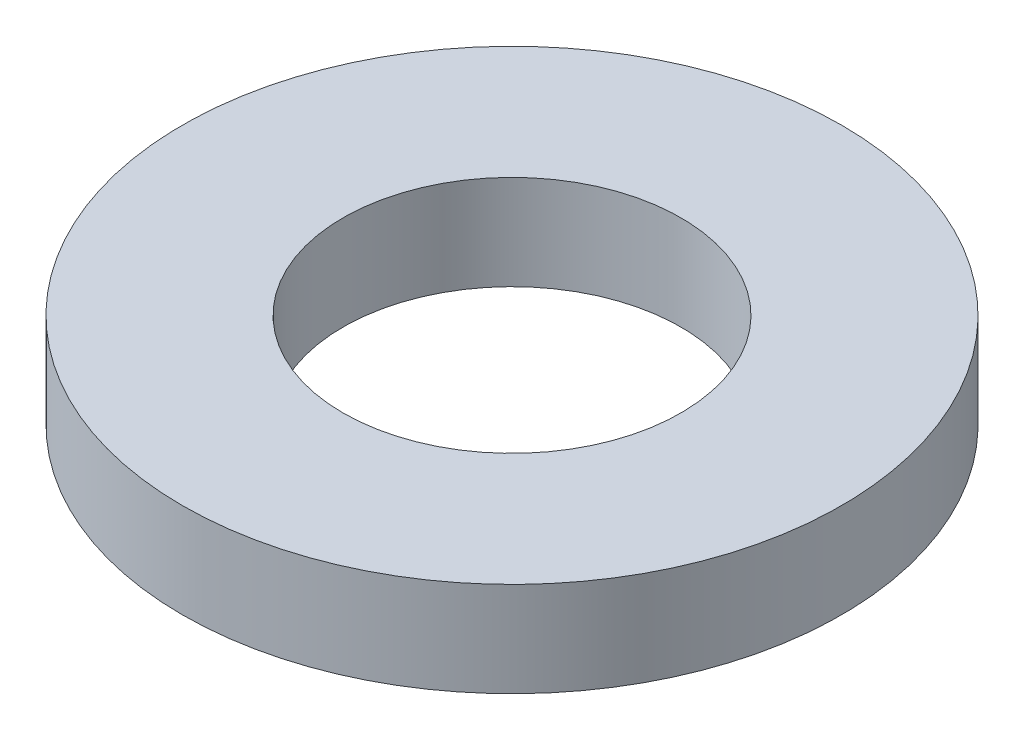
ISO-10303-21;
HEADER;
FILE_DESCRIPTION(('STEP AP214'),'2;1');
FILE_NAME('part.step','',(''),(''),'','','');
FILE_SCHEMA(('AUTOMOTIVE_DESIGN { 1 0 10303 214 1 1 1 1 }'));
ENDSEC;
DATA;
#1=APPLICATION_CONTEXT('core data for automotive mechanical design processes');
#2=APPLICATION_PROTOCOL_DEFINITION('international standard','automotive_design',2000,#1);
#3=PRODUCT_CONTEXT('',#1,'mechanical');
#4=PRODUCT('Part','Part','',(#3));
#5=PRODUCT_RELATED_PRODUCT_CATEGORY('part','',(#4));
#6=PRODUCT_DEFINITION_FORMATION('','',#4);
#7=PRODUCT_DEFINITION_CONTEXT('part definition',#1,'design');
#8=PRODUCT_DEFINITION('design','',#6,#7);
#9=PRODUCT_DEFINITION_SHAPE('','',#8);
#10=(LENGTH_UNIT() NAMED_UNIT(*) SI_UNIT(.MILLI.,.METRE.));
#11=(NAMED_UNIT(*) PLANE_ANGLE_UNIT() SI_UNIT($,.RADIAN.));
#12=(NAMED_UNIT(*) SI_UNIT($,.STERADIAN.) SOLID_ANGLE_UNIT());
#13=UNCERTAINTY_MEASURE_WITH_UNIT(LENGTH_MEASURE(1.E-05),#10,'distance_accuracy_value','');
#14=(GEOMETRIC_REPRESENTATION_CONTEXT(3) GLOBAL_UNCERTAINTY_ASSIGNED_CONTEXT((#13)) GLOBAL_UNIT_ASSIGNED_CONTEXT((#10,
#11,#12)) REPRESENTATION_CONTEXT('',''));
#15=CARTESIAN_POINT('',(0.,0.,0.));
#16=DIRECTION('',(0.,0.,1.));
#17=DIRECTION('',(1.,0.,0.));
#18=AXIS2_PLACEMENT_3D('',#15,#16,#17);
#19=CARTESIAN_POINT('',(0.,28.,0.));
#20=DIRECTION('',(0.,-1.,0.));
#21=DIRECTION('',(0.,0.,-1.));
#22=AXIS2_PLACEMENT_3D('',#19,#20,#21);
#23=CYLINDRICAL_SURFACE('',#22,97.5);
#24=CARTESIAN_POINT('',(0.,28.,0.));
#25=DIRECTION('',(0.,1.,0.));
#26=DIRECTION('',(0.,0.,1.));
#27=AXIS2_PLACEMENT_3D('',#24,#25,#26);
#28=CIRCLE('',#27,97.5);
#29=CARTESIAN_POINT('',(0.,28.,97.5));
#30=VERTEX_POINT('',#29);
#31=EDGE_CURVE('E10',#30,#30,#28,.T.);
#32=ORIENTED_EDGE('',*,*,#31,.F.);
#33=EDGE_LOOP('',(#32));
#34=FACE_BOUND('',#33,.T.);
#35=CARTESIAN_POINT('',(0.,0.,0.));
#36=DIRECTION('',(0.,1.,0.));
#37=DIRECTION('',(0.,0.,1.));
#38=AXIS2_PLACEMENT_3D('',#35,#36,#37);
#39=CIRCLE('',#38,97.5);
#40=CARTESIAN_POINT('',(0.,0.,97.5));
#41=VERTEX_POINT('',#40);
#42=EDGE_CURVE('E37',#41,#41,#39,.T.);
#43=ORIENTED_EDGE('',*,*,#42,.T.);
#44=EDGE_LOOP('',(#43));
#45=FACE_BOUND('',#44,.T.);
#46=ADVANCED_FACE('F40',(#34,#45),#23,.T.);
#47=CARTESIAN_POINT('',(0.,28.,0.));
#48=DIRECTION('',(0.,1.,0.));
#49=DIRECTION('',(0.,0.,1.));
#50=AXIS2_PLACEMENT_3D('',#47,#48,#49);
#51=PLANE('',#50);
#52=CARTESIAN_POINT('',(0.,28.,0.));
#53=DIRECTION('',(0.,1.,0.));
#54=DIRECTION('',(0.,0.,1.));
#55=AXIS2_PLACEMENT_3D('',#52,#53,#54);
#56=CIRCLE('',#55,50.);
#57=CARTESIAN_POINT('',(0.,28.,50.));
#58=VERTEX_POINT('',#57);
#59=EDGE_CURVE('E50',#58,#58,#56,.T.);
#60=ORIENTED_EDGE('',*,*,#59,.F.);
#61=EDGE_LOOP('',(#60));
#62=FACE_BOUND('',#61,.T.);
#63=ORIENTED_EDGE('',*,*,#31,.T.);
#64=EDGE_LOOP('',(#63));
#65=FACE_BOUND('',#64,.T.);
#66=ADVANCED_FACE('F59',(#62,#65),#51,.T.);
#67=CARTESIAN_POINT('',(0.,0.,0.));
#68=DIRECTION('',(0.,1.,0.));
#69=DIRECTION('',(0.,0.,1.));
#70=AXIS2_PLACEMENT_3D('',#67,#68,#69);
#71=PLANE('',#70);
#72=CARTESIAN_POINT('',(0.,0.,0.));
#73=DIRECTION('',(0.,1.,0.));
#74=DIRECTION('',(0.,0.,1.));
#75=AXIS2_PLACEMENT_3D('',#72,#73,#74);
#76=CIRCLE('',#75,50.);
#77=CARTESIAN_POINT('',(0.,0.,50.));
#78=VERTEX_POINT('',#77);
#79=EDGE_CURVE('E47',#78,#78,#76,.T.);
#80=ORIENTED_EDGE('',*,*,#79,.T.);
#81=EDGE_LOOP('',(#80));
#82=FACE_BOUND('',#81,.T.);
#83=ORIENTED_EDGE('',*,*,#42,.F.);
#84=EDGE_LOOP('',(#83));
#85=FACE_BOUND('',#84,.T.);
#86=ADVANCED_FACE('F58',(#82,#85),#71,.F.);
#87=CARTESIAN_POINT('',(0.,28.,0.));
#88=DIRECTION('',(0.,-1.,0.));
#89=DIRECTION('',(0.,0.,-1.));
#90=AXIS2_PLACEMENT_3D('',#87,#88,#89);
#91=CYLINDRICAL_SURFACE('',#90,50.);
#92=ORIENTED_EDGE('',*,*,#59,.T.);
#93=EDGE_LOOP('',(#92));
#94=FACE_BOUND('',#93,.T.);
#95=ORIENTED_EDGE('',*,*,#79,.F.);
#96=EDGE_LOOP('',(#95));
#97=FACE_BOUND('',#96,.T.);
#98=ADVANCED_FACE('F54',(#94,#97),#91,.F.);
#99=CLOSED_SHELL('',(#46,#66,#86,#98));
#100=MANIFOLD_SOLID_BREP('B2',#99);
#101=ADVANCED_BREP_SHAPE_REPRESENTATION('',(#18,#100),#14);
#102=SHAPE_DEFINITION_REPRESENTATION(#9,#101);
ENDSEC;
END-ISO-10303-21;
